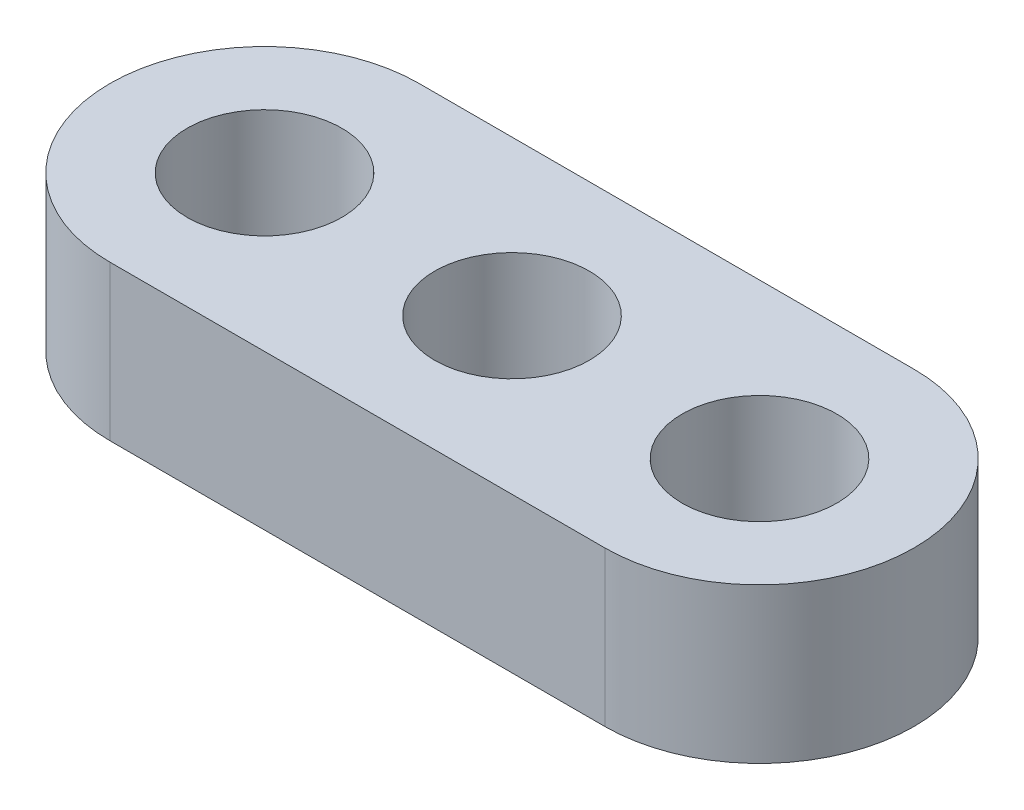
ISO-10303-21;
HEADER;
FILE_DESCRIPTION(('STEP AP214'),'2;1');
FILE_NAME('part.step','',(''),(''),'','','');
FILE_SCHEMA(('AUTOMOTIVE_DESIGN { 1 0 10303 214 1 1 1 1 }'));
ENDSEC;
DATA;
#1=APPLICATION_CONTEXT('core data for automotive mechanical design processes');
#2=APPLICATION_PROTOCOL_DEFINITION('international standard','automotive_design',2000,#1);
#3=PRODUCT_CONTEXT('',#1,'mechanical');
#4=PRODUCT('Part','Part','',(#3));
#5=PRODUCT_RELATED_PRODUCT_CATEGORY('part','',(#4));
#6=PRODUCT_DEFINITION_FORMATION('','',#4);
#7=PRODUCT_DEFINITION_CONTEXT('part definition',#1,'design');
#8=PRODUCT_DEFINITION('design','',#6,#7);
#9=PRODUCT_DEFINITION_SHAPE('','',#8);
#10=(LENGTH_UNIT() NAMED_UNIT(*) SI_UNIT(.MILLI.,.METRE.));
#11=(NAMED_UNIT(*) PLANE_ANGLE_UNIT() SI_UNIT($,.RADIAN.));
#12=(NAMED_UNIT(*) SI_UNIT($,.STERADIAN.) SOLID_ANGLE_UNIT());
#13=UNCERTAINTY_MEASURE_WITH_UNIT(LENGTH_MEASURE(1.E-05),#10,'distance_accuracy_value','');
#14=(GEOMETRIC_REPRESENTATION_CONTEXT(3) GLOBAL_UNCERTAINTY_ASSIGNED_CONTEXT((#13)) GLOBAL_UNIT_ASSIGNED_CONTEXT((#10,
#11,#12)) REPRESENTATION_CONTEXT('',''));
#15=CARTESIAN_POINT('',(0.,0.,0.));
#16=DIRECTION('',(0.,0.,1.));
#17=DIRECTION('',(1.,0.,0.));
#18=AXIS2_PLACEMENT_3D('',#15,#16,#17);
#19=CARTESIAN_POINT('',(10.16,3.175,0.));
#20=DIRECTION('',(0.,1.,0.));
#21=DIRECTION('',(0.,0.,1.));
#22=AXIS2_PLACEMENT_3D('',#19,#20,#21);
#23=PLANE('',#22);
#24=CARTESIAN_POINT('',(5.08,3.175,0.));
#25=DIRECTION('',(0.,1.,0.));
#26=DIRECTION('',(0.,0.,1.));
#27=AXIS2_PLACEMENT_3D('',#24,#25,#26);
#28=CIRCLE('',#27,1.5875);
#29=CARTESIAN_POINT('',(5.08,3.175,1.5875));
#30=VERTEX_POINT('',#29);
#31=EDGE_CURVE('E124',#30,#30,#28,.T.);
#32=ORIENTED_EDGE('',*,*,#31,.F.);
#33=EDGE_LOOP('',(#32));
#34=FACE_BOUND('',#33,.T.);
#35=CARTESIAN_POINT('',(10.16,3.175,0.));
#36=DIRECTION('',(0.,1.,0.));
#37=DIRECTION('',(0.,0.,1.));
#38=AXIS2_PLACEMENT_3D('',#35,#36,#37);
#39=CIRCLE('',#38,3.175);
#40=CARTESIAN_POINT('',(10.16,3.175,3.175));
#41=VERTEX_POINT('',#40);
#42=CARTESIAN_POINT('',(10.16,3.175,-3.175));
#43=VERTEX_POINT('',#42);
#44=EDGE_CURVE('E90',#41,#43,#39,.T.);
#45=ORIENTED_EDGE('',*,*,#44,.T.);
#46=DIRECTION('',(-1.,0.,0.));
#47=VECTOR('',#46,1.);
#48=CARTESIAN_POINT('',(10.16,3.175,-3.175));
#49=LINE('',#48,#47);
#50=CARTESIAN_POINT('',(0.,3.175,-3.175));
#51=VERTEX_POINT('',#50);
#52=EDGE_CURVE('E85',#43,#51,#49,.T.);
#53=ORIENTED_EDGE('',*,*,#52,.T.);
#54=CARTESIAN_POINT('',(0.,3.175,0.));
#55=DIRECTION('',(0.,1.,0.));
#56=DIRECTION('',(0.,0.,1.));
#57=AXIS2_PLACEMENT_3D('',#54,#55,#56);
#58=CIRCLE('',#57,3.175);
#59=CARTESIAN_POINT('',(0.,3.175,3.175));
#60=VERTEX_POINT('',#59);
#61=EDGE_CURVE('E88',#51,#60,#58,.T.);
#62=ORIENTED_EDGE('',*,*,#61,.T.);
#63=DIRECTION('',(1.,0.,0.));
#64=VECTOR('',#63,1.);
#65=CARTESIAN_POINT('',(0.,3.175,3.175));
#66=LINE('',#65,#64);
#67=EDGE_CURVE('E55',#60,#41,#66,.T.);
#68=ORIENTED_EDGE('',*,*,#67,.T.);
#69=EDGE_LOOP('',(#45,#53,#62,#68));
#70=FACE_BOUND('',#69,.T.);
#71=CARTESIAN_POINT('',(0.,3.175,0.));
#72=DIRECTION('',(0.,1.,0.));
#73=DIRECTION('',(0.,0.,1.));
#74=AXIS2_PLACEMENT_3D('',#71,#72,#73);
#75=CIRCLE('',#74,1.5875);
#76=CARTESIAN_POINT('',(0.,3.175,1.5875));
#77=VERTEX_POINT('',#76);
#78=EDGE_CURVE('E113',#77,#77,#75,.T.);
#79=ORIENTED_EDGE('',*,*,#78,.F.);
#80=EDGE_LOOP('',(#79));
#81=FACE_BOUND('',#80,.T.);
#82=CARTESIAN_POINT('',(10.16,3.175,0.));
#83=DIRECTION('',(0.,1.,0.));
#84=DIRECTION('',(0.,0.,1.));
#85=AXIS2_PLACEMENT_3D('',#82,#83,#84);
#86=CIRCLE('',#85,1.5875);
#87=CARTESIAN_POINT('',(10.16,3.175,1.5875));
#88=VERTEX_POINT('',#87);
#89=EDGE_CURVE('E134',#88,#88,#86,.T.);
#90=ORIENTED_EDGE('',*,*,#89,.F.);
#91=EDGE_LOOP('',(#90));
#92=FACE_BOUND('',#91,.T.);
#93=ADVANCED_FACE('F38',(#34,#70,#81,#92),#23,.T.);
#94=CARTESIAN_POINT('',(10.16,0.,0.));
#95=DIRECTION('',(0.,1.,0.));
#96=DIRECTION('',(0.,0.,1.));
#97=AXIS2_PLACEMENT_3D('',#94,#95,#96);
#98=PLANE('',#97);
#99=CARTESIAN_POINT('',(5.08,0.,0.));
#100=DIRECTION('',(0.,1.,0.));
#101=DIRECTION('',(0.,0.,1.));
#102=AXIS2_PLACEMENT_3D('',#99,#100,#101);
#103=CIRCLE('',#102,1.5875);
#104=CARTESIAN_POINT('',(5.08,0.,1.5875));
#105=VERTEX_POINT('',#104);
#106=EDGE_CURVE('E121',#105,#105,#103,.T.);
#107=ORIENTED_EDGE('',*,*,#106,.T.);
#108=EDGE_LOOP('',(#107));
#109=FACE_BOUND('',#108,.T.);
#110=CARTESIAN_POINT('',(10.16,0.,0.));
#111=DIRECTION('',(0.,1.,0.));
#112=DIRECTION('',(0.,0.,1.));
#113=AXIS2_PLACEMENT_3D('',#110,#111,#112);
#114=CIRCLE('',#113,3.175);
#115=CARTESIAN_POINT('',(10.16,0.,3.175));
#116=VERTEX_POINT('',#115);
#117=CARTESIAN_POINT('',(10.16,0.,-3.175));
#118=VERTEX_POINT('',#117);
#119=EDGE_CURVE('E119',#116,#118,#114,.T.);
#120=ORIENTED_EDGE('',*,*,#119,.F.);
#121=DIRECTION('',(1.,0.,0.));
#122=VECTOR('',#121,1.);
#123=CARTESIAN_POINT('',(0.,0.,3.175));
#124=LINE('',#123,#122);
#125=CARTESIAN_POINT('',(0.,0.,3.175));
#126=VERTEX_POINT('',#125);
#127=EDGE_CURVE('E78',#126,#116,#124,.T.);
#128=ORIENTED_EDGE('',*,*,#127,.F.);
#129=CARTESIAN_POINT('',(0.,0.,0.));
#130=DIRECTION('',(0.,1.,0.));
#131=DIRECTION('',(0.,0.,1.));
#132=AXIS2_PLACEMENT_3D('',#129,#130,#131);
#133=CIRCLE('',#132,3.175);
#134=CARTESIAN_POINT('',(0.,0.,-3.175));
#135=VERTEX_POINT('',#134);
#136=EDGE_CURVE('E72',#135,#126,#133,.T.);
#137=ORIENTED_EDGE('',*,*,#136,.F.);
#138=DIRECTION('',(-1.,0.,0.));
#139=VECTOR('',#138,1.);
#140=CARTESIAN_POINT('',(10.16,0.,-3.175));
#141=LINE('',#140,#139);
#142=EDGE_CURVE('E95',#118,#135,#141,.T.);
#143=ORIENTED_EDGE('',*,*,#142,.F.);
#144=EDGE_LOOP('',(#120,#128,#137,#143));
#145=FACE_BOUND('',#144,.T.);
#146=CARTESIAN_POINT('',(0.,0.,0.));
#147=DIRECTION('',(0.,1.,0.));
#148=DIRECTION('',(0.,0.,1.));
#149=AXIS2_PLACEMENT_3D('',#146,#147,#148);
#150=CIRCLE('',#149,1.5875);
#151=CARTESIAN_POINT('',(0.,0.,1.5875));
#152=VERTEX_POINT('',#151);
#153=EDGE_CURVE('E120',#152,#152,#150,.T.);
#154=ORIENTED_EDGE('',*,*,#153,.T.);
#155=EDGE_LOOP('',(#154));
#156=FACE_BOUND('',#155,.T.);
#157=CARTESIAN_POINT('',(10.16,0.,0.));
#158=DIRECTION('',(0.,1.,0.));
#159=DIRECTION('',(0.,0.,1.));
#160=AXIS2_PLACEMENT_3D('',#157,#158,#159);
#161=CIRCLE('',#160,1.5875);
#162=CARTESIAN_POINT('',(10.16,0.,1.5875));
#163=VERTEX_POINT('',#162);
#164=EDGE_CURVE('E132',#163,#163,#161,.T.);
#165=ORIENTED_EDGE('',*,*,#164,.T.);
#166=EDGE_LOOP('',(#165));
#167=FACE_BOUND('',#166,.T.);
#168=ADVANCED_FACE('F143',(#109,#145,#156,#167),#98,.F.);
#169=CARTESIAN_POINT('',(10.16,3.175,0.));
#170=DIRECTION('',(0.,-1.,0.));
#171=DIRECTION('',(0.,0.,-1.));
#172=AXIS2_PLACEMENT_3D('',#169,#170,#171);
#173=CYLINDRICAL_SURFACE('',#172,3.175);
#174=ORIENTED_EDGE('',*,*,#119,.T.);
#175=DIRECTION('',(0.,-1.,0.));
#176=VECTOR('',#175,1.);
#177=CARTESIAN_POINT('',(10.16,3.175,-3.175));
#178=LINE('',#177,#176);
#179=EDGE_CURVE('E12',#43,#118,#178,.T.);
#180=ORIENTED_EDGE('',*,*,#179,.F.);
#181=ORIENTED_EDGE('',*,*,#44,.F.);
#182=DIRECTION('',(0.,-1.,0.));
#183=VECTOR('',#182,1.);
#184=CARTESIAN_POINT('',(10.16,3.175,3.175));
#185=LINE('',#184,#183);
#186=EDGE_CURVE('E101',#41,#116,#185,.T.);
#187=ORIENTED_EDGE('',*,*,#186,.T.);
#188=EDGE_LOOP('',(#174,#180,#181,#187));
#189=FACE_BOUND('',#188,.T.);
#190=ADVANCED_FACE('F40',(#189),#173,.T.);
#191=CARTESIAN_POINT('',(10.16,3.175,-3.175));
#192=DIRECTION('',(0.,0.,1.));
#193=DIRECTION('',(1.,0.,0.));
#194=AXIS2_PLACEMENT_3D('',#191,#192,#193);
#195=PLANE('',#194);
#196=ORIENTED_EDGE('',*,*,#142,.T.);
#197=DIRECTION('',(0.,-1.,0.));
#198=VECTOR('',#197,1.);
#199=CARTESIAN_POINT('',(0.,3.175,-3.175));
#200=LINE('',#199,#198);
#201=EDGE_CURVE('E47',#51,#135,#200,.T.);
#202=ORIENTED_EDGE('',*,*,#201,.F.);
#203=ORIENTED_EDGE('',*,*,#52,.F.);
#204=ORIENTED_EDGE('',*,*,#179,.T.);
#205=EDGE_LOOP('',(#196,#202,#203,#204));
#206=FACE_BOUND('',#205,.T.);
#207=ADVANCED_FACE('F94',(#206),#195,.F.);
#208=CARTESIAN_POINT('',(0.,3.175,0.));
#209=DIRECTION('',(0.,-1.,0.));
#210=DIRECTION('',(0.,0.,-1.));
#211=AXIS2_PLACEMENT_3D('',#208,#209,#210);
#212=CYLINDRICAL_SURFACE('',#211,3.175);
#213=ORIENTED_EDGE('',*,*,#136,.T.);
#214=DIRECTION('',(0.,-1.,0.));
#215=VECTOR('',#214,1.);
#216=CARTESIAN_POINT('',(0.,3.175,3.175));
#217=LINE('',#216,#215);
#218=EDGE_CURVE('E96',#60,#126,#217,.T.);
#219=ORIENTED_EDGE('',*,*,#218,.F.);
#220=ORIENTED_EDGE('',*,*,#61,.F.);
#221=ORIENTED_EDGE('',*,*,#201,.T.);
#222=EDGE_LOOP('',(#213,#219,#220,#221));
#223=FACE_BOUND('',#222,.T.);
#224=ADVANCED_FACE('F97',(#223),#212,.T.);
#225=CARTESIAN_POINT('',(0.,3.175,3.175));
#226=DIRECTION('',(0.,0.,-1.));
#227=DIRECTION('',(-1.,0.,0.));
#228=AXIS2_PLACEMENT_3D('',#225,#226,#227);
#229=PLANE('',#228);
#230=ORIENTED_EDGE('',*,*,#127,.T.);
#231=ORIENTED_EDGE('',*,*,#186,.F.);
#232=ORIENTED_EDGE('',*,*,#67,.F.);
#233=ORIENTED_EDGE('',*,*,#218,.T.);
#234=EDGE_LOOP('',(#230,#231,#232,#233));
#235=FACE_BOUND('',#234,.T.);
#236=ADVANCED_FACE('F157',(#235),#229,.F.);
#237=CARTESIAN_POINT('',(0.,3.175,0.));
#238=DIRECTION('',(0.,-1.,0.));
#239=DIRECTION('',(0.,0.,-1.));
#240=AXIS2_PLACEMENT_3D('',#237,#238,#239);
#241=CYLINDRICAL_SURFACE('',#240,1.5875);
#242=ORIENTED_EDGE('',*,*,#78,.T.);
#243=EDGE_LOOP('',(#242));
#244=FACE_BOUND('',#243,.T.);
#245=ORIENTED_EDGE('',*,*,#153,.F.);
#246=EDGE_LOOP('',(#245));
#247=FACE_BOUND('',#246,.T.);
#248=ADVANCED_FACE('F149',(#244,#247),#241,.F.);
#249=CARTESIAN_POINT('',(5.08,3.175,0.));
#250=DIRECTION('',(0.,-1.,0.));
#251=DIRECTION('',(0.,0.,-1.));
#252=AXIS2_PLACEMENT_3D('',#249,#250,#251);
#253=CYLINDRICAL_SURFACE('',#252,1.5875);
#254=ORIENTED_EDGE('',*,*,#31,.T.);
#255=EDGE_LOOP('',(#254));
#256=FACE_BOUND('',#255,.T.);
#257=ORIENTED_EDGE('',*,*,#106,.F.);
#258=EDGE_LOOP('',(#257));
#259=FACE_BOUND('',#258,.T.);
#260=ADVANCED_FACE('F146',(#256,#259),#253,.F.);
#261=CARTESIAN_POINT('',(10.16,3.175,0.));
#262=DIRECTION('',(0.,-1.,0.));
#263=DIRECTION('',(0.,0.,-1.));
#264=AXIS2_PLACEMENT_3D('',#261,#262,#263);
#265=CYLINDRICAL_SURFACE('',#264,1.5875);
#266=ORIENTED_EDGE('',*,*,#89,.T.);
#267=EDGE_LOOP('',(#266));
#268=FACE_BOUND('',#267,.T.);
#269=ORIENTED_EDGE('',*,*,#164,.F.);
#270=EDGE_LOOP('',(#269));
#271=FACE_BOUND('',#270,.T.);
#272=ADVANCED_FACE('F148',(#268,#271),#265,.F.);
#273=CLOSED_SHELL('',(#93,#168,#190,#207,#224,#236,#248,#260,#272));
#274=MANIFOLD_SOLID_BREP('B2',#273);
#275=ADVANCED_BREP_SHAPE_REPRESENTATION('',(#18,#274),#14);
#276=SHAPE_DEFINITION_REPRESENTATION(#9,#275);
ENDSEC;
END-ISO-10303-21;
